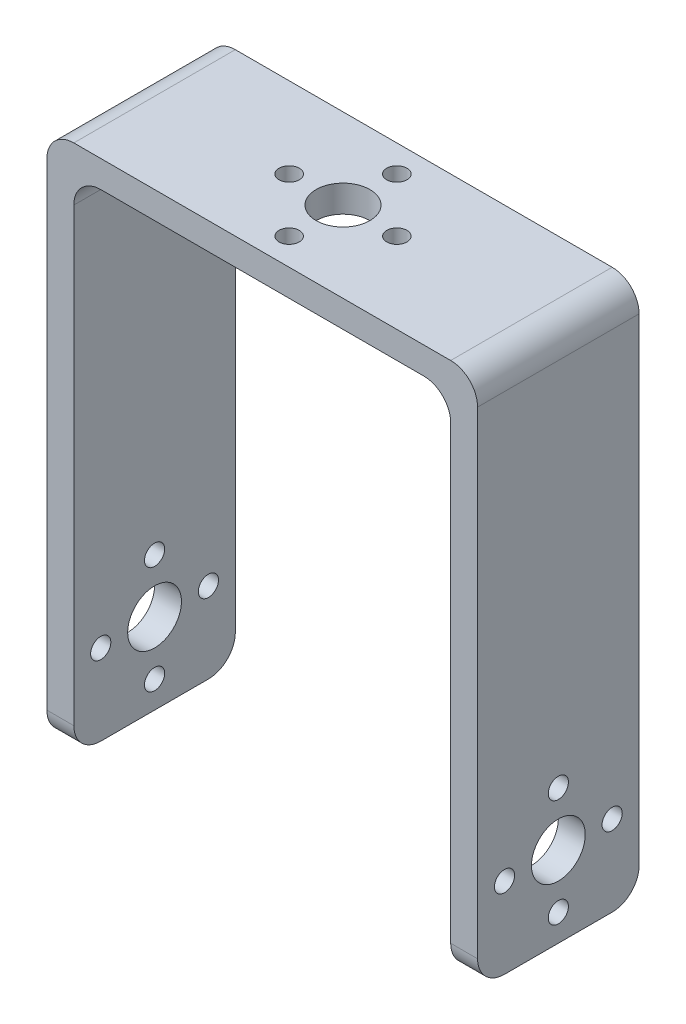
ISO-10303-21;
HEADER;
FILE_DESCRIPTION(('STEP AP214'),'2;1');
FILE_NAME('part.step','',(''),(''),'','','');
FILE_SCHEMA(('AUTOMOTIVE_DESIGN { 1 0 10303 214 1 1 1 1 }'));
ENDSEC;
DATA;
#1=APPLICATION_CONTEXT('core data for automotive mechanical design processes');
#2=APPLICATION_PROTOCOL_DEFINITION('international standard','automotive_design',2000,#1);
#3=PRODUCT_CONTEXT('',#1,'mechanical');
#4=PRODUCT('Part','Part','',(#3));
#5=PRODUCT_RELATED_PRODUCT_CATEGORY('part','',(#4));
#6=PRODUCT_DEFINITION_FORMATION('','',#4);
#7=PRODUCT_DEFINITION_CONTEXT('part definition',#1,'design');
#8=PRODUCT_DEFINITION('design','',#6,#7);
#9=PRODUCT_DEFINITION_SHAPE('','',#8);
#10=(LENGTH_UNIT() NAMED_UNIT(*) SI_UNIT(.MILLI.,.METRE.));
#11=(NAMED_UNIT(*) PLANE_ANGLE_UNIT() SI_UNIT($,.RADIAN.));
#12=(NAMED_UNIT(*) SI_UNIT($,.STERADIAN.) SOLID_ANGLE_UNIT());
#13=UNCERTAINTY_MEASURE_WITH_UNIT(LENGTH_MEASURE(1.E-05),#10,'distance_accuracy_value','');
#14=(GEOMETRIC_REPRESENTATION_CONTEXT(3) GLOBAL_UNCERTAINTY_ASSIGNED_CONTEXT((#13)) GLOBAL_UNIT_ASSIGNED_CONTEXT((#10,
#11,#12)) REPRESENTATION_CONTEXT('',''));
#15=CARTESIAN_POINT('',(0.,0.,0.));
#16=DIRECTION('',(0.,0.,1.));
#17=DIRECTION('',(1.,0.,0.));
#18=AXIS2_PLACEMENT_3D('',#15,#16,#17);
#19=CARTESIAN_POINT('',(20.0522878512897,0.,24.));
#20=DIRECTION('',(1.,0.,0.));
#21=DIRECTION('',(0.,0.,-1.));
#22=AXIS2_PLACEMENT_3D('',#19,#20,#21);
#23=PLANE('',#22);
#24=CARTESIAN_POINT('',(20.0522878512897,-26.738038277512,4.));
#25=DIRECTION('',(1.,0.,0.));
#26=DIRECTION('',(0.,0.,-1.));
#27=AXIS2_PLACEMENT_3D('',#24,#25,#26);
#28=CIRCLE('',#27,1.5);
#29=CARTESIAN_POINT('',(20.0522878512897,-26.738038277512,2.5));
#30=VERTEX_POINT('',#29);
#31=EDGE_CURVE('E337',#30,#30,#28,.T.);
#32=ORIENTED_EDGE('',*,*,#31,.T.);
#33=EDGE_LOOP('',(#32));
#34=FACE_BOUND('',#33,.T.);
#35=CARTESIAN_POINT('',(20.0522878512897,-26.7380382775119,20.));
#36=DIRECTION('',(1.,0.,0.));
#37=DIRECTION('',(0.,0.,-1.));
#38=AXIS2_PLACEMENT_3D('',#35,#36,#37);
#39=CIRCLE('',#38,1.5);
#40=CARTESIAN_POINT('',(20.0522878512897,-26.7380382775119,18.5));
#41=VERTEX_POINT('',#40);
#42=EDGE_CURVE('E331',#41,#41,#39,.T.);
#43=ORIENTED_EDGE('',*,*,#42,.T.);
#44=EDGE_LOOP('',(#43));
#45=FACE_BOUND('',#44,.T.);
#46=CARTESIAN_POINT('',(20.0522878512897,-34.738038277512,12.));
#47=DIRECTION('',(1.,0.,0.));
#48=DIRECTION('',(0.,0.,-1.));
#49=AXIS2_PLACEMENT_3D('',#46,#47,#48);
#50=CIRCLE('',#49,1.5);
#51=CARTESIAN_POINT('',(20.0522878512897,-34.738038277512,10.5));
#52=VERTEX_POINT('',#51);
#53=EDGE_CURVE('E325',#52,#52,#50,.T.);
#54=ORIENTED_EDGE('',*,*,#53,.T.);
#55=EDGE_LOOP('',(#54));
#56=FACE_BOUND('',#55,.T.);
#57=CARTESIAN_POINT('',(20.0522878512897,-18.738038277512,11.9999999999999));
#58=DIRECTION('',(1.,0.,0.));
#59=DIRECTION('',(0.,0.,-1.));
#60=AXIS2_PLACEMENT_3D('',#57,#58,#59);
#61=CIRCLE('',#60,1.5);
#62=CARTESIAN_POINT('',(20.0522878512897,-18.738038277512,10.4999999999999));
#63=VERTEX_POINT('',#62);
#64=EDGE_CURVE('E319',#63,#63,#61,.T.);
#65=ORIENTED_EDGE('',*,*,#64,.T.);
#66=EDGE_LOOP('',(#65));
#67=FACE_BOUND('',#66,.T.);
#68=CARTESIAN_POINT('',(20.0522878512897,-26.738038277512,12.));
#69=DIRECTION('',(1.,0.,0.));
#70=DIRECTION('',(0.,0.,-1.));
#71=AXIS2_PLACEMENT_3D('',#68,#69,#70);
#72=CIRCLE('',#71,4.);
#73=CARTESIAN_POINT('',(20.0522878512897,-26.738038277512,8.));
#74=VERTEX_POINT('',#73);
#75=EDGE_CURVE('E272',#74,#74,#72,.T.);
#76=ORIENTED_EDGE('',*,*,#75,.T.);
#77=EDGE_LOOP('',(#76));
#78=FACE_BOUND('',#77,.T.);
#79=DIRECTION('',(0.,-1.,0.));
#80=VECTOR('',#79,1.);
#81=CARTESIAN_POINT('',(20.0522878512897,0.,24.));
#82=LINE('',#81,#80);
#83=CARTESIAN_POINT('',(20.0522878512897,32.261961722488,24.));
#84=VERTEX_POINT('',#83);
#85=CARTESIAN_POINT('',(20.0522878512897,-34.738038277512,24.));
#86=VERTEX_POINT('',#85);
#87=EDGE_CURVE('E175',#84,#86,#82,.T.);
#88=ORIENTED_EDGE('',*,*,#87,.F.);
#89=DIRECTION('',(0.,0.,-1.));
#90=VECTOR('',#89,1.);
#91=CARTESIAN_POINT('',(20.0522878512897,32.261961722488,0.));
#92=LINE('',#91,#90);
#93=CARTESIAN_POINT('',(20.0522878512897,32.261961722488,0.));
#94=VERTEX_POINT('',#93);
#95=EDGE_CURVE('E235',#84,#94,#92,.T.);
#96=ORIENTED_EDGE('',*,*,#95,.T.);
#97=DIRECTION('',(0.,-1.,0.));
#98=VECTOR('',#97,1.);
#99=CARTESIAN_POINT('',(20.0522878512897,0.,0.));
#100=LINE('',#99,#98);
#101=CARTESIAN_POINT('',(20.0522878512897,-34.738038277512,0.));
#102=VERTEX_POINT('',#101);
#103=EDGE_CURVE('E268',#94,#102,#100,.T.);
#104=ORIENTED_EDGE('',*,*,#103,.T.);
#105=CARTESIAN_POINT('',(20.0522878512897,-34.738038277512,4.));
#106=DIRECTION('',(1.,0.,0.));
#107=DIRECTION('',(0.,0.,-1.));
#108=AXIS2_PLACEMENT_3D('',#105,#106,#107);
#109=CIRCLE('',#108,4.);
#110=CARTESIAN_POINT('',(20.0522878512897,-38.738038277512,4.));
#111=VERTEX_POINT('',#110);
#112=EDGE_CURVE('E233',#102,#111,#109,.F.);
#113=ORIENTED_EDGE('',*,*,#112,.T.);
#114=DIRECTION('',(0.,0.,-1.));
#115=VECTOR('',#114,1.);
#116=CARTESIAN_POINT('',(20.0522878512897,-38.738038277512,24.));
#117=LINE('',#116,#115);
#118=CARTESIAN_POINT('',(20.0522878512897,-38.738038277512,20.));
#119=VERTEX_POINT('',#118);
#120=EDGE_CURVE('E193',#119,#111,#117,.T.);
#121=ORIENTED_EDGE('',*,*,#120,.F.);
#122=CARTESIAN_POINT('',(20.0522878512897,-34.738038277512,20.));
#123=DIRECTION('',(1.,0.,0.));
#124=DIRECTION('',(0.,0.,-1.));
#125=AXIS2_PLACEMENT_3D('',#122,#123,#124);
#126=CIRCLE('',#125,4.);
#127=EDGE_CURVE('E231',#119,#86,#126,.F.);
#128=ORIENTED_EDGE('',*,*,#127,.T.);
#129=EDGE_LOOP('',(#88,#96,#104,#113,#121,#128));
#130=FACE_BOUND('',#129,.T.);
#131=ADVANCED_FACE('F34',(#34,#45,#56,#67,#78,#130),#23,.F.);
#132=CARTESIAN_POINT('',(0.,-38.738038277512,24.));
#133=DIRECTION('',(0.,1.,0.));
#134=DIRECTION('',(0.,0.,1.));
#135=AXIS2_PLACEMENT_3D('',#132,#133,#134);
#136=PLANE('',#135);
#137=ORIENTED_EDGE('',*,*,#120,.T.);
#138=DIRECTION('',(1.,0.,0.));
#139=VECTOR('',#138,1.);
#140=CARTESIAN_POINT('',(0.,-38.738038277512,4.));
#141=LINE('',#140,#139);
#142=CARTESIAN_POINT('',(24.0522878512897,-38.738038277512,4.));
#143=VERTEX_POINT('',#142);
#144=EDGE_CURVE('E244',#111,#143,#141,.T.);
#145=ORIENTED_EDGE('',*,*,#144,.T.);
#146=DIRECTION('',(0.,0.,-1.));
#147=VECTOR('',#146,1.);
#148=CARTESIAN_POINT('',(24.0522878512897,-38.738038277512,24.));
#149=LINE('',#148,#147);
#150=CARTESIAN_POINT('',(24.0522878512897,-38.738038277512,20.));
#151=VERTEX_POINT('',#150);
#152=EDGE_CURVE('E191',#151,#143,#149,.T.);
#153=ORIENTED_EDGE('',*,*,#152,.F.);
#154=DIRECTION('',(1.,0.,0.));
#155=VECTOR('',#154,1.);
#156=CARTESIAN_POINT('',(20.0522878512897,-38.738038277512,20.));
#157=LINE('',#156,#155);
#158=EDGE_CURVE('E242',#151,#119,#157,.F.);
#159=ORIENTED_EDGE('',*,*,#158,.T.);
#160=EDGE_LOOP('',(#137,#145,#153,#159));
#161=FACE_BOUND('',#160,.T.);
#162=ADVANCED_FACE('F431',(#161),#136,.F.);
#163=CARTESIAN_POINT('',(24.0522878512897,0.,24.));
#164=DIRECTION('',(1.,0.,0.));
#165=DIRECTION('',(0.,0.,-1.));
#166=AXIS2_PLACEMENT_3D('',#163,#164,#165);
#167=PLANE('',#166);
#168=CARTESIAN_POINT('',(24.0522878512897,-26.738038277512,4.));
#169=DIRECTION('',(1.,0.,0.));
#170=DIRECTION('',(0.,0.,-1.));
#171=AXIS2_PLACEMENT_3D('',#168,#169,#170);
#172=CIRCLE('',#171,1.5);
#173=CARTESIAN_POINT('',(24.0522878512897,-26.738038277512,2.5));
#174=VERTEX_POINT('',#173);
#175=EDGE_CURVE('E334',#174,#174,#172,.T.);
#176=ORIENTED_EDGE('',*,*,#175,.F.);
#177=EDGE_LOOP('',(#176));
#178=FACE_BOUND('',#177,.T.);
#179=CARTESIAN_POINT('',(24.0522878512897,-26.7380382775119,20.));
#180=DIRECTION('',(1.,0.,0.));
#181=DIRECTION('',(0.,0.,-1.));
#182=AXIS2_PLACEMENT_3D('',#179,#180,#181);
#183=CIRCLE('',#182,1.5);
#184=CARTESIAN_POINT('',(24.0522878512897,-26.7380382775119,18.5));
#185=VERTEX_POINT('',#184);
#186=EDGE_CURVE('E328',#185,#185,#183,.T.);
#187=ORIENTED_EDGE('',*,*,#186,.F.);
#188=EDGE_LOOP('',(#187));
#189=FACE_BOUND('',#188,.T.);
#190=CARTESIAN_POINT('',(24.0522878512897,-34.738038277512,12.));
#191=DIRECTION('',(1.,0.,0.));
#192=DIRECTION('',(0.,0.,-1.));
#193=AXIS2_PLACEMENT_3D('',#190,#191,#192);
#194=CIRCLE('',#193,1.5);
#195=CARTESIAN_POINT('',(24.0522878512897,-34.738038277512,10.5));
#196=VERTEX_POINT('',#195);
#197=EDGE_CURVE('E322',#196,#196,#194,.T.);
#198=ORIENTED_EDGE('',*,*,#197,.F.);
#199=EDGE_LOOP('',(#198));
#200=FACE_BOUND('',#199,.T.);
#201=CARTESIAN_POINT('',(24.0522878512897,-18.738038277512,11.9999999999999));
#202=DIRECTION('',(1.,0.,0.));
#203=DIRECTION('',(0.,0.,-1.));
#204=AXIS2_PLACEMENT_3D('',#201,#202,#203);
#205=CIRCLE('',#204,1.5);
#206=CARTESIAN_POINT('',(24.0522878512897,-18.738038277512,10.4999999999999));
#207=VERTEX_POINT('',#206);
#208=EDGE_CURVE('E316',#207,#207,#205,.T.);
#209=ORIENTED_EDGE('',*,*,#208,.F.);
#210=EDGE_LOOP('',(#209));
#211=FACE_BOUND('',#210,.T.);
#212=CARTESIAN_POINT('',(24.0522878512897,-26.738038277512,12.));
#213=DIRECTION('',(1.,0.,0.));
#214=DIRECTION('',(0.,0.,-1.));
#215=AXIS2_PLACEMENT_3D('',#212,#213,#214);
#216=CIRCLE('',#215,4.);
#217=CARTESIAN_POINT('',(24.0522878512897,-26.738038277512,8.));
#218=VERTEX_POINT('',#217);
#219=EDGE_CURVE('E313',#218,#218,#216,.T.);
#220=ORIENTED_EDGE('',*,*,#219,.F.);
#221=EDGE_LOOP('',(#220));
#222=FACE_BOUND('',#221,.T.);
#223=DIRECTION('',(0.,-1.,0.));
#224=VECTOR('',#223,1.);
#225=CARTESIAN_POINT('',(24.0522878512897,0.,0.));
#226=LINE('',#225,#224);
#227=CARTESIAN_POINT('',(24.0522878512897,36.261961722488,0.));
#228=VERTEX_POINT('',#227);
#229=CARTESIAN_POINT('',(24.0522878512897,-34.738038277512,0.));
#230=VERTEX_POINT('',#229);
#231=EDGE_CURVE('E271',#228,#230,#226,.T.);
#232=ORIENTED_EDGE('',*,*,#231,.F.);
#233=DIRECTION('',(0.,0.,-1.));
#234=VECTOR('',#233,1.);
#235=CARTESIAN_POINT('',(24.0522878512897,36.261961722488,24.));
#236=LINE('',#235,#234);
#237=CARTESIAN_POINT('',(24.0522878512897,36.261961722488,24.));
#238=VERTEX_POINT('',#237);
#239=EDGE_CURVE('E240',#228,#238,#236,.F.);
#240=ORIENTED_EDGE('',*,*,#239,.T.);
#241=DIRECTION('',(0.,-1.,0.));
#242=VECTOR('',#241,1.);
#243=CARTESIAN_POINT('',(24.0522878512897,0.,24.));
#244=LINE('',#243,#242);
#245=CARTESIAN_POINT('',(24.0522878512897,-34.738038277512,24.));
#246=VERTEX_POINT('',#245);
#247=EDGE_CURVE('E179',#238,#246,#244,.T.);
#248=ORIENTED_EDGE('',*,*,#247,.T.);
#249=CARTESIAN_POINT('',(24.0522878512897,-34.738038277512,20.));
#250=DIRECTION('',(1.,0.,0.));
#251=DIRECTION('',(0.,0.,-1.));
#252=AXIS2_PLACEMENT_3D('',#249,#250,#251);
#253=CIRCLE('',#252,4.);
#254=EDGE_CURVE('E57',#246,#151,#253,.T.);
#255=ORIENTED_EDGE('',*,*,#254,.T.);
#256=ORIENTED_EDGE('',*,*,#152,.T.);
#257=CARTESIAN_POINT('',(24.0522878512897,-34.738038277512,4.));
#258=DIRECTION('',(1.,0.,0.));
#259=DIRECTION('',(0.,0.,-1.));
#260=AXIS2_PLACEMENT_3D('',#257,#258,#259);
#261=CIRCLE('',#260,4.);
#262=EDGE_CURVE('E49',#143,#230,#261,.T.);
#263=ORIENTED_EDGE('',*,*,#262,.T.);
#264=EDGE_LOOP('',(#232,#240,#248,#255,#256,#263));
#265=FACE_BOUND('',#264,.T.);
#266=ADVANCED_FACE('F306',(#178,#189,#200,#211,#222,#265),#167,.T.);
#267=CARTESIAN_POINT('',(0.,40.261961722488,24.));
#268=DIRECTION('',(0.,1.,0.));
#269=DIRECTION('',(0.,0.,1.));
#270=AXIS2_PLACEMENT_3D('',#267,#268,#269);
#271=PLANE('',#270);
#272=CARTESIAN_POINT('',(-7.94771214871035,40.261961722488,12.));
#273=DIRECTION('',(0.,1.,0.));
#274=DIRECTION('',(0.,0.,1.));
#275=AXIS2_PLACEMENT_3D('',#272,#273,#274);
#276=CIRCLE('',#275,4.);
#277=CARTESIAN_POINT('',(-7.94771214871035,40.261961722488,16.));
#278=VERTEX_POINT('',#277);
#279=EDGE_CURVE('E394',#278,#278,#276,.T.);
#280=ORIENTED_EDGE('',*,*,#279,.F.);
#281=EDGE_LOOP('',(#280));
#282=FACE_BOUND('',#281,.T.);
#283=CARTESIAN_POINT('',(-15.9477121487103,40.261961722488,11.9999999999999));
#284=DIRECTION('',(0.,1.,0.));
#285=DIRECTION('',(0.,0.,1.));
#286=AXIS2_PLACEMENT_3D('',#283,#284,#285);
#287=CIRCLE('',#286,1.5);
#288=CARTESIAN_POINT('',(-15.9477121487103,40.261961722488,13.4999999999999));
#289=VERTEX_POINT('',#288);
#290=EDGE_CURVE('E388',#289,#289,#287,.T.);
#291=ORIENTED_EDGE('',*,*,#290,.F.);
#292=EDGE_LOOP('',(#291));
#293=FACE_BOUND('',#292,.T.);
#294=CARTESIAN_POINT('',(-7.94771214871038,40.261961722488,20.));
#295=DIRECTION('',(0.,1.,0.));
#296=DIRECTION('',(0.,0.,1.));
#297=AXIS2_PLACEMENT_3D('',#294,#295,#296);
#298=CIRCLE('',#297,1.5);
#299=CARTESIAN_POINT('',(-7.94771214871038,40.261961722488,21.5));
#300=VERTEX_POINT('',#299);
#301=EDGE_CURVE('E382',#300,#300,#298,.T.);
#302=ORIENTED_EDGE('',*,*,#301,.F.);
#303=EDGE_LOOP('',(#302));
#304=FACE_BOUND('',#303,.T.);
#305=CARTESIAN_POINT('',(0.0522878512896549,40.261961722488,12.));
#306=DIRECTION('',(0.,1.,0.));
#307=DIRECTION('',(0.,0.,1.));
#308=AXIS2_PLACEMENT_3D('',#305,#306,#307);
#309=CIRCLE('',#308,1.5);
#310=CARTESIAN_POINT('',(0.0522878512896549,40.261961722488,13.5));
#311=VERTEX_POINT('',#310);
#312=EDGE_CURVE('E376',#311,#311,#309,.T.);
#313=ORIENTED_EDGE('',*,*,#312,.F.);
#314=EDGE_LOOP('',(#313));
#315=FACE_BOUND('',#314,.T.);
#316=CARTESIAN_POINT('',(-7.94771214871025,40.261961722488,4.));
#317=DIRECTION('',(0.,1.,0.));
#318=DIRECTION('',(0.,0.,1.));
#319=AXIS2_PLACEMENT_3D('',#316,#317,#318);
#320=CIRCLE('',#319,1.5);
#321=CARTESIAN_POINT('',(-7.94771214871025,40.261961722488,5.5));
#322=VERTEX_POINT('',#321);
#323=EDGE_CURVE('E373',#322,#322,#320,.T.);
#324=ORIENTED_EDGE('',*,*,#323,.F.);
#325=EDGE_LOOP('',(#324));
#326=FACE_BOUND('',#325,.T.);
#327=DIRECTION('',(1.,0.,0.));
#328=VECTOR('',#327,1.);
#329=CARTESIAN_POINT('',(0.,40.261961722488,0.));
#330=LINE('',#329,#328);
#331=CARTESIAN_POINT('',(-35.9477121487103,40.261961722488,0.));
#332=VERTEX_POINT('',#331);
#333=CARTESIAN_POINT('',(20.0522878512897,40.261961722488,0.));
#334=VERTEX_POINT('',#333);
#335=EDGE_CURVE('E275',#332,#334,#330,.T.);
#336=ORIENTED_EDGE('',*,*,#335,.F.);
#337=DIRECTION('',(0.,0.,-1.));
#338=VECTOR('',#337,1.);
#339=CARTESIAN_POINT('',(-35.9477121487103,40.261961722488,24.));
#340=LINE('',#339,#338);
#341=CARTESIAN_POINT('',(-35.9477121487103,40.261961722488,24.));
#342=VERTEX_POINT('',#341);
#343=EDGE_CURVE('E219',#332,#342,#340,.F.);
#344=ORIENTED_EDGE('',*,*,#343,.T.);
#345=DIRECTION('',(1.,0.,0.));
#346=VECTOR('',#345,1.);
#347=CARTESIAN_POINT('',(0.,40.261961722488,24.));
#348=LINE('',#347,#346);
#349=CARTESIAN_POINT('',(20.0522878512897,40.261961722488,24.));
#350=VERTEX_POINT('',#349);
#351=EDGE_CURVE('E264',#342,#350,#348,.T.);
#352=ORIENTED_EDGE('',*,*,#351,.T.);
#353=DIRECTION('',(0.,0.,-1.));
#354=VECTOR('',#353,1.);
#355=CARTESIAN_POINT('',(20.0522878512897,40.261961722488,24.));
#356=LINE('',#355,#354);
#357=EDGE_CURVE('E216',#350,#334,#356,.T.);
#358=ORIENTED_EDGE('',*,*,#357,.T.);
#359=EDGE_LOOP('',(#336,#344,#352,#358));
#360=FACE_BOUND('',#359,.T.);
#361=ADVANCED_FACE('F301',(#282,#293,#304,#315,#326,#360),#271,.T.);
#362=CARTESIAN_POINT('',(-39.9477121487103,0.,24.));
#363=DIRECTION('',(-1.,0.,0.));
#364=DIRECTION('',(0.,0.,1.));
#365=AXIS2_PLACEMENT_3D('',#362,#363,#364);
#366=PLANE('',#365);
#367=CARTESIAN_POINT('',(-39.9477121487103,-26.7380382775119,4.));
#368=DIRECTION('',(-1.,0.,0.));
#369=DIRECTION('',(0.,0.,1.));
#370=AXIS2_PLACEMENT_3D('',#367,#368,#369);
#371=CIRCLE('',#370,1.5);
#372=CARTESIAN_POINT('',(-39.9477121487103,-26.7380382775119,5.5));
#373=VERTEX_POINT('',#372);
#374=EDGE_CURVE('E364',#373,#373,#371,.T.);
#375=ORIENTED_EDGE('',*,*,#374,.F.);
#376=EDGE_LOOP('',(#375));
#377=FACE_BOUND('',#376,.T.);
#378=CARTESIAN_POINT('',(-39.9477121487103,-34.738038277512,12.));
#379=DIRECTION('',(-1.,0.,0.));
#380=DIRECTION('',(0.,0.,1.));
#381=AXIS2_PLACEMENT_3D('',#378,#379,#380);
#382=CIRCLE('',#381,1.5);
#383=CARTESIAN_POINT('',(-39.9477121487103,-34.738038277512,13.5));
#384=VERTEX_POINT('',#383);
#385=EDGE_CURVE('E358',#384,#384,#382,.T.);
#386=ORIENTED_EDGE('',*,*,#385,.F.);
#387=EDGE_LOOP('',(#386));
#388=FACE_BOUND('',#387,.T.);
#389=CARTESIAN_POINT('',(-39.9477121487103,-26.738038277512,12.));
#390=DIRECTION('',(-1.,0.,0.));
#391=DIRECTION('',(0.,0.,1.));
#392=AXIS2_PLACEMENT_3D('',#389,#390,#391);
#393=CIRCLE('',#392,4.);
#394=CARTESIAN_POINT('',(-39.9477121487103,-26.738038277512,16.));
#395=VERTEX_POINT('',#394);
#396=EDGE_CURVE('E352',#395,#395,#393,.T.);
#397=ORIENTED_EDGE('',*,*,#396,.F.);
#398=EDGE_LOOP('',(#397));
#399=FACE_BOUND('',#398,.T.);
#400=CARTESIAN_POINT('',(-39.9477121487103,-26.738038277512,20.));
#401=DIRECTION('',(-1.,0.,0.));
#402=DIRECTION('',(0.,0.,1.));
#403=AXIS2_PLACEMENT_3D('',#400,#401,#402);
#404=CIRCLE('',#403,1.5);
#405=CARTESIAN_POINT('',(-39.9477121487103,-26.738038277512,21.5));
#406=VERTEX_POINT('',#405);
#407=EDGE_CURVE('E346',#406,#406,#404,.T.);
#408=ORIENTED_EDGE('',*,*,#407,.F.);
#409=EDGE_LOOP('',(#408));
#410=FACE_BOUND('',#409,.T.);
#411=CARTESIAN_POINT('',(-39.9477121487103,-18.738038277512,12.0000000000001));
#412=DIRECTION('',(-1.,0.,0.));
#413=DIRECTION('',(0.,0.,1.));
#414=AXIS2_PLACEMENT_3D('',#411,#412,#413);
#415=CIRCLE('',#414,1.5);
#416=CARTESIAN_POINT('',(-39.9477121487103,-18.738038277512,13.5000000000001));
#417=VERTEX_POINT('',#416);
#418=EDGE_CURVE('E343',#417,#417,#415,.T.);
#419=ORIENTED_EDGE('',*,*,#418,.F.);
#420=EDGE_LOOP('',(#419));
#421=FACE_BOUND('',#420,.T.);
#422=DIRECTION('',(0.,1.,0.));
#423=VECTOR('',#422,1.);
#424=CARTESIAN_POINT('',(-39.9477121487103,0.,24.));
#425=LINE('',#424,#423);
#426=CARTESIAN_POINT('',(-39.9477121487103,-34.738038277512,24.));
#427=VERTEX_POINT('',#426);
#428=CARTESIAN_POINT('',(-39.9477121487103,36.261961722488,24.));
#429=VERTEX_POINT('',#428);
#430=EDGE_CURVE('E260',#427,#429,#425,.T.);
#431=ORIENTED_EDGE('',*,*,#430,.T.);
#432=DIRECTION('',(0.,0.,-1.));
#433=VECTOR('',#432,1.);
#434=CARTESIAN_POINT('',(-39.9477121487103,36.261961722488,24.));
#435=LINE('',#434,#433);
#436=CARTESIAN_POINT('',(-39.9477121487103,36.261961722488,0.));
#437=VERTEX_POINT('',#436);
#438=EDGE_CURVE('E205',#429,#437,#435,.T.);
#439=ORIENTED_EDGE('',*,*,#438,.T.);
#440=DIRECTION('',(0.,1.,0.));
#441=VECTOR('',#440,1.);
#442=CARTESIAN_POINT('',(-39.9477121487103,0.,0.));
#443=LINE('',#442,#441);
#444=CARTESIAN_POINT('',(-39.9477121487103,-34.738038277512,0.));
#445=VERTEX_POINT('',#444);
#446=EDGE_CURVE('E181',#445,#437,#443,.T.);
#447=ORIENTED_EDGE('',*,*,#446,.F.);
#448=CARTESIAN_POINT('',(-39.9477121487103,-34.738038277512,4.));
#449=DIRECTION('',(-1.,0.,0.));
#450=DIRECTION('',(0.,0.,1.));
#451=AXIS2_PLACEMENT_3D('',#448,#449,#450);
#452=CIRCLE('',#451,4.);
#453=CARTESIAN_POINT('',(-39.9477121487103,-38.738038277512,4.));
#454=VERTEX_POINT('',#453);
#455=EDGE_CURVE('E203',#445,#454,#452,.T.);
#456=ORIENTED_EDGE('',*,*,#455,.T.);
#457=DIRECTION('',(0.,0.,-1.));
#458=VECTOR('',#457,1.);
#459=CARTESIAN_POINT('',(-39.9477121487103,-38.738038277512,24.));
#460=LINE('',#459,#458);
#461=CARTESIAN_POINT('',(-39.9477121487103,-38.738038277512,20.));
#462=VERTEX_POINT('',#461);
#463=EDGE_CURVE('E188',#462,#454,#460,.T.);
#464=ORIENTED_EDGE('',*,*,#463,.F.);
#465=CARTESIAN_POINT('',(-39.9477121487103,-34.738038277512,20.));
#466=DIRECTION('',(-1.,0.,0.));
#467=DIRECTION('',(0.,0.,1.));
#468=AXIS2_PLACEMENT_3D('',#465,#466,#467);
#469=CIRCLE('',#468,4.);
#470=EDGE_CURVE('E201',#462,#427,#469,.T.);
#471=ORIENTED_EDGE('',*,*,#470,.T.);
#472=EDGE_LOOP('',(#431,#439,#447,#456,#464,#471));
#473=FACE_BOUND('',#472,.T.);
#474=ADVANCED_FACE('F282',(#377,#388,#399,#410,#421,#473),#366,.T.);
#475=CARTESIAN_POINT('',(0.,-38.738038277512,24.));
#476=DIRECTION('',(0.,1.,0.));
#477=DIRECTION('',(0.,0.,1.));
#478=AXIS2_PLACEMENT_3D('',#475,#476,#477);
#479=PLANE('',#478);
#480=ORIENTED_EDGE('',*,*,#463,.T.);
#481=DIRECTION('',(1.,0.,0.));
#482=VECTOR('',#481,1.);
#483=CARTESIAN_POINT('',(0.,-38.738038277512,4.));
#484=LINE('',#483,#482);
#485=CARTESIAN_POINT('',(-35.9477121487103,-38.738038277512,4.));
#486=VERTEX_POINT('',#485);
#487=EDGE_CURVE('E159',#454,#486,#484,.T.);
#488=ORIENTED_EDGE('',*,*,#487,.T.);
#489=DIRECTION('',(0.,0.,-1.));
#490=VECTOR('',#489,1.);
#491=CARTESIAN_POINT('',(-35.9477121487103,-38.738038277512,24.));
#492=LINE('',#491,#490);
#493=CARTESIAN_POINT('',(-35.9477121487103,-38.738038277512,20.));
#494=VERTEX_POINT('',#493);
#495=EDGE_CURVE('E185',#494,#486,#492,.T.);
#496=ORIENTED_EDGE('',*,*,#495,.F.);
#497=DIRECTION('',(1.,0.,0.));
#498=VECTOR('',#497,1.);
#499=CARTESIAN_POINT('',(-39.9477121487103,-38.738038277512,20.));
#500=LINE('',#499,#498);
#501=EDGE_CURVE('E246',#494,#462,#500,.F.);
#502=ORIENTED_EDGE('',*,*,#501,.T.);
#503=EDGE_LOOP('',(#480,#488,#496,#502));
#504=FACE_BOUND('',#503,.T.);
#505=ADVANCED_FACE('F290',(#504),#479,.F.);
#506=CARTESIAN_POINT('',(-35.9477121487103,0.,24.));
#507=DIRECTION('',(-1.,0.,0.));
#508=DIRECTION('',(0.,0.,1.));
#509=AXIS2_PLACEMENT_3D('',#506,#507,#508);
#510=PLANE('',#509);
#511=CARTESIAN_POINT('',(-35.9477121487103,-26.7380382775119,4.));
#512=DIRECTION('',(-1.,0.,0.));
#513=DIRECTION('',(0.,0.,1.));
#514=AXIS2_PLACEMENT_3D('',#511,#512,#513);
#515=CIRCLE('',#514,1.5);
#516=CARTESIAN_POINT('',(-35.9477121487103,-26.7380382775119,5.5));
#517=VERTEX_POINT('',#516);
#518=EDGE_CURVE('E367',#517,#517,#515,.T.);
#519=ORIENTED_EDGE('',*,*,#518,.T.);
#520=EDGE_LOOP('',(#519));
#521=FACE_BOUND('',#520,.T.);
#522=CARTESIAN_POINT('',(-35.9477121487103,-34.738038277512,12.));
#523=DIRECTION('',(-1.,0.,0.));
#524=DIRECTION('',(0.,0.,1.));
#525=AXIS2_PLACEMENT_3D('',#522,#523,#524);
#526=CIRCLE('',#525,1.5);
#527=CARTESIAN_POINT('',(-35.9477121487103,-34.738038277512,13.5));
#528=VERTEX_POINT('',#527);
#529=EDGE_CURVE('E361',#528,#528,#526,.T.);
#530=ORIENTED_EDGE('',*,*,#529,.T.);
#531=EDGE_LOOP('',(#530));
#532=FACE_BOUND('',#531,.T.);
#533=CARTESIAN_POINT('',(-35.9477121487103,-26.738038277512,12.));
#534=DIRECTION('',(-1.,0.,0.));
#535=DIRECTION('',(0.,0.,1.));
#536=AXIS2_PLACEMENT_3D('',#533,#534,#535);
#537=CIRCLE('',#536,4.);
#538=CARTESIAN_POINT('',(-35.9477121487103,-26.738038277512,16.));
#539=VERTEX_POINT('',#538);
#540=EDGE_CURVE('E355',#539,#539,#537,.T.);
#541=ORIENTED_EDGE('',*,*,#540,.T.);
#542=EDGE_LOOP('',(#541));
#543=FACE_BOUND('',#542,.T.);
#544=CARTESIAN_POINT('',(-35.9477121487103,-26.738038277512,20.));
#545=DIRECTION('',(-1.,0.,0.));
#546=DIRECTION('',(0.,0.,1.));
#547=AXIS2_PLACEMENT_3D('',#544,#545,#546);
#548=CIRCLE('',#547,1.5);
#549=CARTESIAN_POINT('',(-35.9477121487103,-26.738038277512,21.5));
#550=VERTEX_POINT('',#549);
#551=EDGE_CURVE('E349',#550,#550,#548,.T.);
#552=ORIENTED_EDGE('',*,*,#551,.T.);
#553=EDGE_LOOP('',(#552));
#554=FACE_BOUND('',#553,.T.);
#555=CARTESIAN_POINT('',(-35.9477121487103,-18.738038277512,12.0000000000001));
#556=DIRECTION('',(-1.,0.,0.));
#557=DIRECTION('',(0.,0.,1.));
#558=AXIS2_PLACEMENT_3D('',#555,#556,#557);
#559=CIRCLE('',#558,1.5);
#560=CARTESIAN_POINT('',(-35.9477121487103,-18.738038277512,13.5000000000001));
#561=VERTEX_POINT('',#560);
#562=EDGE_CURVE('E340',#561,#561,#559,.T.);
#563=ORIENTED_EDGE('',*,*,#562,.T.);
#564=EDGE_LOOP('',(#563));
#565=FACE_BOUND('',#564,.T.);
#566=DIRECTION('',(0.,1.,0.));
#567=VECTOR('',#566,1.);
#568=CARTESIAN_POINT('',(-35.9477121487103,0.,0.));
#569=LINE('',#568,#567);
#570=CARTESIAN_POINT('',(-35.9477121487103,-34.738038277512,0.));
#571=VERTEX_POINT('',#570);
#572=CARTESIAN_POINT('',(-35.9477121487103,32.261961722488,0.));
#573=VERTEX_POINT('',#572);
#574=EDGE_CURVE('E176',#571,#573,#569,.T.);
#575=ORIENTED_EDGE('',*,*,#574,.T.);
#576=DIRECTION('',(0.,0.,-1.));
#577=VECTOR('',#576,1.);
#578=CARTESIAN_POINT('',(-35.9477121487103,32.261961722488,24.));
#579=LINE('',#578,#577);
#580=CARTESIAN_POINT('',(-35.9477121487103,32.261961722488,24.));
#581=VERTEX_POINT('',#580);
#582=EDGE_CURVE('E153',#573,#581,#579,.F.);
#583=ORIENTED_EDGE('',*,*,#582,.T.);
#584=DIRECTION('',(0.,1.,0.));
#585=VECTOR('',#584,1.);
#586=CARTESIAN_POINT('',(-35.9477121487103,0.,24.));
#587=LINE('',#586,#585);
#588=CARTESIAN_POINT('',(-35.9477121487103,-34.738038277512,24.));
#589=VERTEX_POINT('',#588);
#590=EDGE_CURVE('E256',#589,#581,#587,.T.);
#591=ORIENTED_EDGE('',*,*,#590,.F.);
#592=CARTESIAN_POINT('',(-35.9477121487103,-34.738038277512,20.));
#593=DIRECTION('',(-1.,0.,0.));
#594=DIRECTION('',(0.,0.,1.));
#595=AXIS2_PLACEMENT_3D('',#592,#593,#594);
#596=CIRCLE('',#595,4.);
#597=EDGE_CURVE('E169',#589,#494,#596,.F.);
#598=ORIENTED_EDGE('',*,*,#597,.T.);
#599=ORIENTED_EDGE('',*,*,#495,.T.);
#600=CARTESIAN_POINT('',(-35.9477121487103,-34.738038277512,4.));
#601=DIRECTION('',(-1.,0.,0.));
#602=DIRECTION('',(0.,0.,1.));
#603=AXIS2_PLACEMENT_3D('',#600,#601,#602);
#604=CIRCLE('',#603,4.);
#605=EDGE_CURVE('E198',#486,#571,#604,.F.);
#606=ORIENTED_EDGE('',*,*,#605,.T.);
#607=EDGE_LOOP('',(#575,#583,#591,#598,#599,#606));
#608=FACE_BOUND('',#607,.T.);
#609=ADVANCED_FACE('F292',(#521,#532,#543,#554,#565,#608),#510,.F.);
#610=CARTESIAN_POINT('',(0.,36.261961722488,24.));
#611=DIRECTION('',(0.,1.,0.));
#612=DIRECTION('',(0.,0.,1.));
#613=AXIS2_PLACEMENT_3D('',#610,#611,#612);
#614=PLANE('',#613);
#615=CARTESIAN_POINT('',(-7.94771214871035,36.261961722488,12.));
#616=DIRECTION('',(0.,1.,0.));
#617=DIRECTION('',(0.,0.,1.));
#618=AXIS2_PLACEMENT_3D('',#615,#616,#617);
#619=CIRCLE('',#618,4.);
#620=CARTESIAN_POINT('',(-7.94771214871035,36.261961722488,16.));
#621=VERTEX_POINT('',#620);
#622=EDGE_CURVE('E397',#621,#621,#619,.T.);
#623=ORIENTED_EDGE('',*,*,#622,.T.);
#624=EDGE_LOOP('',(#623));
#625=FACE_BOUND('',#624,.T.);
#626=CARTESIAN_POINT('',(-15.9477121487103,36.261961722488,11.9999999999999));
#627=DIRECTION('',(0.,1.,0.));
#628=DIRECTION('',(0.,0.,1.));
#629=AXIS2_PLACEMENT_3D('',#626,#627,#628);
#630=CIRCLE('',#629,1.5);
#631=CARTESIAN_POINT('',(-15.9477121487103,36.261961722488,13.4999999999999));
#632=VERTEX_POINT('',#631);
#633=EDGE_CURVE('E391',#632,#632,#630,.T.);
#634=ORIENTED_EDGE('',*,*,#633,.T.);
#635=EDGE_LOOP('',(#634));
#636=FACE_BOUND('',#635,.T.);
#637=CARTESIAN_POINT('',(-7.94771214871038,36.261961722488,20.));
#638=DIRECTION('',(0.,1.,0.));
#639=DIRECTION('',(0.,0.,1.));
#640=AXIS2_PLACEMENT_3D('',#637,#638,#639);
#641=CIRCLE('',#640,1.5);
#642=CARTESIAN_POINT('',(-7.94771214871038,36.261961722488,21.5));
#643=VERTEX_POINT('',#642);
#644=EDGE_CURVE('E385',#643,#643,#641,.T.);
#645=ORIENTED_EDGE('',*,*,#644,.T.);
#646=EDGE_LOOP('',(#645));
#647=FACE_BOUND('',#646,.T.);
#648=CARTESIAN_POINT('',(0.0522878512896549,36.261961722488,12.));
#649=DIRECTION('',(0.,1.,0.));
#650=DIRECTION('',(0.,0.,1.));
#651=AXIS2_PLACEMENT_3D('',#648,#649,#650);
#652=CIRCLE('',#651,1.5);
#653=CARTESIAN_POINT('',(0.0522878512896549,36.261961722488,13.5));
#654=VERTEX_POINT('',#653);
#655=EDGE_CURVE('E379',#654,#654,#652,.T.);
#656=ORIENTED_EDGE('',*,*,#655,.T.);
#657=EDGE_LOOP('',(#656));
#658=FACE_BOUND('',#657,.T.);
#659=CARTESIAN_POINT('',(-7.94771214871025,36.261961722488,4.));
#660=DIRECTION('',(0.,1.,0.));
#661=DIRECTION('',(0.,0.,1.));
#662=AXIS2_PLACEMENT_3D('',#659,#660,#661);
#663=CIRCLE('',#662,1.5);
#664=CARTESIAN_POINT('',(-7.94771214871025,36.261961722488,5.5));
#665=VERTEX_POINT('',#664);
#666=EDGE_CURVE('E370',#665,#665,#663,.T.);
#667=ORIENTED_EDGE('',*,*,#666,.T.);
#668=EDGE_LOOP('',(#667));
#669=FACE_BOUND('',#668,.T.);
#670=DIRECTION('',(1.,0.,0.));
#671=VECTOR('',#670,1.);
#672=CARTESIAN_POINT('',(0.,36.261961722488,24.));
#673=LINE('',#672,#671);
#674=CARTESIAN_POINT('',(-31.9477121487103,36.261961722488,24.));
#675=VERTEX_POINT('',#674);
#676=CARTESIAN_POINT('',(16.0522878512897,36.261961722488,24.));
#677=VERTEX_POINT('',#676);
#678=EDGE_CURVE('E168',#675,#677,#673,.T.);
#679=ORIENTED_EDGE('',*,*,#678,.F.);
#680=DIRECTION('',(0.,0.,-1.));
#681=VECTOR('',#680,1.);
#682=CARTESIAN_POINT('',(-31.9477121487103,36.261961722488,0.));
#683=LINE('',#682,#681);
#684=CARTESIAN_POINT('',(-31.9477121487103,36.261961722488,0.));
#685=VERTEX_POINT('',#684);
#686=EDGE_CURVE('E152',#675,#685,#683,.T.);
#687=ORIENTED_EDGE('',*,*,#686,.T.);
#688=DIRECTION('',(1.,0.,0.));
#689=VECTOR('',#688,1.);
#690=CARTESIAN_POINT('',(0.,36.261961722488,0.));
#691=LINE('',#690,#689);
#692=CARTESIAN_POINT('',(16.0522878512897,36.261961722488,0.));
#693=VERTEX_POINT('',#692);
#694=EDGE_CURVE('E165',#685,#693,#691,.T.);
#695=ORIENTED_EDGE('',*,*,#694,.T.);
#696=DIRECTION('',(0.,0.,-1.));
#697=VECTOR('',#696,1.);
#698=CARTESIAN_POINT('',(16.0522878512897,36.261961722488,24.));
#699=LINE('',#698,#697);
#700=EDGE_CURVE('E170',#693,#677,#699,.F.);
#701=ORIENTED_EDGE('',*,*,#700,.T.);
#702=EDGE_LOOP('',(#679,#687,#695,#701));
#703=FACE_BOUND('',#702,.T.);
#704=ADVANCED_FACE('F164',(#625,#636,#647,#658,#669,#703),#614,.F.);
#705=CARTESIAN_POINT('',(0.,0.,24.));
#706=DIRECTION('',(0.,0.,1.));
#707=DIRECTION('',(1.,0.,0.));
#708=AXIS2_PLACEMENT_3D('',#705,#706,#707);
#709=PLANE('',#708);
#710=ORIENTED_EDGE('',*,*,#351,.F.);
#711=CARTESIAN_POINT('',(-35.9477121487103,36.261961722488,24.));
#712=DIRECTION('',(0.,0.,1.));
#713=DIRECTION('',(1.,0.,0.));
#714=AXIS2_PLACEMENT_3D('',#711,#712,#713);
#715=CIRCLE('',#714,4.);
#716=EDGE_CURVE('E229',#342,#429,#715,.T.);
#717=ORIENTED_EDGE('',*,*,#716,.T.);
#718=ORIENTED_EDGE('',*,*,#430,.F.);
#719=DIRECTION('',(1.,0.,0.));
#720=VECTOR('',#719,1.);
#721=CARTESIAN_POINT('',(-35.9477121487103,-34.738038277512,24.));
#722=LINE('',#721,#720);
#723=EDGE_CURVE('E221',#427,#589,#722,.T.);
#724=ORIENTED_EDGE('',*,*,#723,.T.);
#725=ORIENTED_EDGE('',*,*,#590,.T.);
#726=CARTESIAN_POINT('',(-31.9477121487103,32.261961722488,24.));
#727=DIRECTION('',(0.,0.,1.));
#728=DIRECTION('',(1.,0.,0.));
#729=AXIS2_PLACEMENT_3D('',#726,#727,#728);
#730=CIRCLE('',#729,4.);
#731=EDGE_CURVE('E158',#581,#675,#730,.F.);
#732=ORIENTED_EDGE('',*,*,#731,.T.);
#733=ORIENTED_EDGE('',*,*,#678,.T.);
#734=CARTESIAN_POINT('',(16.0522878512897,32.261961722488,24.));
#735=DIRECTION('',(0.,0.,1.));
#736=DIRECTION('',(1.,0.,0.));
#737=AXIS2_PLACEMENT_3D('',#734,#735,#736);
#738=CIRCLE('',#737,4.);
#739=EDGE_CURVE('E11',#677,#84,#738,.F.);
#740=ORIENTED_EDGE('',*,*,#739,.T.);
#741=ORIENTED_EDGE('',*,*,#87,.T.);
#742=DIRECTION('',(1.,0.,0.));
#743=VECTOR('',#742,1.);
#744=CARTESIAN_POINT('',(24.0522878512897,-34.738038277512,24.));
#745=LINE('',#744,#743);
#746=EDGE_CURVE('E224',#86,#246,#745,.T.);
#747=ORIENTED_EDGE('',*,*,#746,.T.);
#748=ORIENTED_EDGE('',*,*,#247,.F.);
#749=CARTESIAN_POINT('',(20.0522878512897,36.261961722488,24.));
#750=DIRECTION('',(0.,0.,1.));
#751=DIRECTION('',(1.,0.,0.));
#752=AXIS2_PLACEMENT_3D('',#749,#750,#751);
#753=CIRCLE('',#752,4.);
#754=EDGE_CURVE('E227',#238,#350,#753,.T.);
#755=ORIENTED_EDGE('',*,*,#754,.T.);
#756=EDGE_LOOP('',(#710,#717,#718,#724,#725,#732,#733,#740,#741,#747,#748,#755));
#757=FACE_BOUND('',#756,.T.);
#758=ADVANCED_FACE('F253',(#757),#709,.T.);
#759=CARTESIAN_POINT('',(0.,0.,0.));
#760=DIRECTION('',(0.,0.,1.));
#761=DIRECTION('',(1.,0.,0.));
#762=AXIS2_PLACEMENT_3D('',#759,#760,#761);
#763=PLANE('',#762);
#764=ORIENTED_EDGE('',*,*,#446,.T.);
#765=CARTESIAN_POINT('',(-35.9477121487103,36.261961722488,0.));
#766=DIRECTION('',(0.,0.,1.));
#767=DIRECTION('',(1.,0.,0.));
#768=AXIS2_PLACEMENT_3D('',#765,#766,#767);
#769=CIRCLE('',#768,4.);
#770=EDGE_CURVE('E214',#437,#332,#769,.F.);
#771=ORIENTED_EDGE('',*,*,#770,.T.);
#772=ORIENTED_EDGE('',*,*,#335,.T.);
#773=CARTESIAN_POINT('',(20.0522878512897,36.261961722488,0.));
#774=DIRECTION('',(0.,0.,1.));
#775=DIRECTION('',(1.,0.,0.));
#776=AXIS2_PLACEMENT_3D('',#773,#774,#775);
#777=CIRCLE('',#776,4.);
#778=EDGE_CURVE('E212',#334,#228,#777,.F.);
#779=ORIENTED_EDGE('',*,*,#778,.T.);
#780=ORIENTED_EDGE('',*,*,#231,.T.);
#781=DIRECTION('',(1.,0.,0.));
#782=VECTOR('',#781,1.);
#783=CARTESIAN_POINT('',(0.,-34.738038277512,0.));
#784=LINE('',#783,#782);
#785=EDGE_CURVE('E210',#230,#102,#784,.F.);
#786=ORIENTED_EDGE('',*,*,#785,.T.);
#787=ORIENTED_EDGE('',*,*,#103,.F.);
#788=CARTESIAN_POINT('',(16.0522878512897,32.261961722488,0.));
#789=DIRECTION('',(0.,0.,1.));
#790=DIRECTION('',(1.,0.,0.));
#791=AXIS2_PLACEMENT_3D('',#788,#789,#790);
#792=CIRCLE('',#791,4.);
#793=EDGE_CURVE('E42',#94,#693,#792,.T.);
#794=ORIENTED_EDGE('',*,*,#793,.T.);
#795=ORIENTED_EDGE('',*,*,#694,.F.);
#796=CARTESIAN_POINT('',(-31.9477121487103,32.261961722488,0.));
#797=DIRECTION('',(0.,0.,1.));
#798=DIRECTION('',(1.,0.,0.));
#799=AXIS2_PLACEMENT_3D('',#796,#797,#798);
#800=CIRCLE('',#799,4.);
#801=EDGE_CURVE('E148',#685,#573,#800,.T.);
#802=ORIENTED_EDGE('',*,*,#801,.T.);
#803=ORIENTED_EDGE('',*,*,#574,.F.);
#804=DIRECTION('',(1.,0.,0.));
#805=VECTOR('',#804,1.);
#806=CARTESIAN_POINT('',(0.,-34.738038277512,0.));
#807=LINE('',#806,#805);
#808=EDGE_CURVE('E208',#571,#445,#807,.F.);
#809=ORIENTED_EDGE('',*,*,#808,.T.);
#810=EDGE_LOOP('',(#764,#771,#772,#779,#780,#786,#787,#794,#795,#802,#803,#809));
#811=FACE_BOUND('',#810,.T.);
#812=ADVANCED_FACE('F173',(#811),#763,.F.);
#813=CARTESIAN_POINT('',(20.0522878512897,-26.738038277512,12.));
#814=DIRECTION('',(1.,0.,0.));
#815=DIRECTION('',(0.,0.,-1.));
#816=AXIS2_PLACEMENT_3D('',#813,#814,#815);
#817=CYLINDRICAL_SURFACE('',#816,4.);
#818=ORIENTED_EDGE('',*,*,#75,.F.);
#819=EDGE_LOOP('',(#818));
#820=FACE_BOUND('',#819,.T.);
#821=ORIENTED_EDGE('',*,*,#219,.T.);
#822=EDGE_LOOP('',(#821));
#823=FACE_BOUND('',#822,.T.);
#824=ADVANCED_FACE('F555',(#820,#823),#817,.F.);
#825=CARTESIAN_POINT('',(20.0522878512897,-18.738038277512,11.9999999999999));
#826=DIRECTION('',(1.,0.,0.));
#827=DIRECTION('',(0.,0.,-1.));
#828=AXIS2_PLACEMENT_3D('',#825,#826,#827);
#829=CYLINDRICAL_SURFACE('',#828,1.5);
#830=ORIENTED_EDGE('',*,*,#64,.F.);
#831=EDGE_LOOP('',(#830));
#832=FACE_BOUND('',#831,.T.);
#833=ORIENTED_EDGE('',*,*,#208,.T.);
#834=EDGE_LOOP('',(#833));
#835=FACE_BOUND('',#834,.T.);
#836=ADVANCED_FACE('F563',(#832,#835),#829,.F.);
#837=CARTESIAN_POINT('',(20.0522878512897,-34.738038277512,12.));
#838=DIRECTION('',(1.,0.,0.));
#839=DIRECTION('',(0.,0.,-1.));
#840=AXIS2_PLACEMENT_3D('',#837,#838,#839);
#841=CYLINDRICAL_SURFACE('',#840,1.5);
#842=ORIENTED_EDGE('',*,*,#53,.F.);
#843=EDGE_LOOP('',(#842));
#844=FACE_BOUND('',#843,.T.);
#845=ORIENTED_EDGE('',*,*,#197,.T.);
#846=EDGE_LOOP('',(#845));
#847=FACE_BOUND('',#846,.T.);
#848=ADVANCED_FACE('F571',(#844,#847),#841,.F.);
#849=CARTESIAN_POINT('',(20.0522878512897,-26.7380382775119,20.));
#850=DIRECTION('',(1.,0.,0.));
#851=DIRECTION('',(0.,0.,-1.));
#852=AXIS2_PLACEMENT_3D('',#849,#850,#851);
#853=CYLINDRICAL_SURFACE('',#852,1.5);
#854=ORIENTED_EDGE('',*,*,#42,.F.);
#855=EDGE_LOOP('',(#854));
#856=FACE_BOUND('',#855,.T.);
#857=ORIENTED_EDGE('',*,*,#186,.T.);
#858=EDGE_LOOP('',(#857));
#859=FACE_BOUND('',#858,.T.);
#860=ADVANCED_FACE('F579',(#856,#859),#853,.F.);
#861=CARTESIAN_POINT('',(20.0522878512897,-26.738038277512,4.));
#862=DIRECTION('',(1.,0.,0.));
#863=DIRECTION('',(0.,0.,-1.));
#864=AXIS2_PLACEMENT_3D('',#861,#862,#863);
#865=CYLINDRICAL_SURFACE('',#864,1.5);
#866=ORIENTED_EDGE('',*,*,#31,.F.);
#867=EDGE_LOOP('',(#866));
#868=FACE_BOUND('',#867,.T.);
#869=ORIENTED_EDGE('',*,*,#175,.T.);
#870=EDGE_LOOP('',(#869));
#871=FACE_BOUND('',#870,.T.);
#872=ADVANCED_FACE('F587',(#868,#871),#865,.F.);
#873=CARTESIAN_POINT('',(-35.9477121487103,-18.738038277512,12.0000000000001));
#874=DIRECTION('',(-1.,0.,0.));
#875=DIRECTION('',(0.,0.,1.));
#876=AXIS2_PLACEMENT_3D('',#873,#874,#875);
#877=CYLINDRICAL_SURFACE('',#876,1.5);
#878=ORIENTED_EDGE('',*,*,#562,.F.);
#879=EDGE_LOOP('',(#878));
#880=FACE_BOUND('',#879,.T.);
#881=ORIENTED_EDGE('',*,*,#418,.T.);
#882=EDGE_LOOP('',(#881));
#883=FACE_BOUND('',#882,.T.);
#884=ADVANCED_FACE('F595',(#880,#883),#877,.F.);
#885=CARTESIAN_POINT('',(-35.9477121487103,-26.738038277512,20.));
#886=DIRECTION('',(-1.,0.,0.));
#887=DIRECTION('',(0.,0.,1.));
#888=AXIS2_PLACEMENT_3D('',#885,#886,#887);
#889=CYLINDRICAL_SURFACE('',#888,1.5);
#890=ORIENTED_EDGE('',*,*,#551,.F.);
#891=EDGE_LOOP('',(#890));
#892=FACE_BOUND('',#891,.T.);
#893=ORIENTED_EDGE('',*,*,#407,.T.);
#894=EDGE_LOOP('',(#893));
#895=FACE_BOUND('',#894,.T.);
#896=ADVANCED_FACE('F603',(#892,#895),#889,.F.);
#897=CARTESIAN_POINT('',(-35.9477121487103,-26.738038277512,12.));
#898=DIRECTION('',(-1.,0.,0.));
#899=DIRECTION('',(0.,0.,1.));
#900=AXIS2_PLACEMENT_3D('',#897,#898,#899);
#901=CYLINDRICAL_SURFACE('',#900,4.);
#902=ORIENTED_EDGE('',*,*,#540,.F.);
#903=EDGE_LOOP('',(#902));
#904=FACE_BOUND('',#903,.T.);
#905=ORIENTED_EDGE('',*,*,#396,.T.);
#906=EDGE_LOOP('',(#905));
#907=FACE_BOUND('',#906,.T.);
#908=ADVANCED_FACE('F611',(#904,#907),#901,.F.);
#909=CARTESIAN_POINT('',(-35.9477121487103,-34.738038277512,12.));
#910=DIRECTION('',(-1.,0.,0.));
#911=DIRECTION('',(0.,0.,1.));
#912=AXIS2_PLACEMENT_3D('',#909,#910,#911);
#913=CYLINDRICAL_SURFACE('',#912,1.5);
#914=ORIENTED_EDGE('',*,*,#529,.F.);
#915=EDGE_LOOP('',(#914));
#916=FACE_BOUND('',#915,.T.);
#917=ORIENTED_EDGE('',*,*,#385,.T.);
#918=EDGE_LOOP('',(#917));
#919=FACE_BOUND('',#918,.T.);
#920=ADVANCED_FACE('F619',(#916,#919),#913,.F.);
#921=CARTESIAN_POINT('',(-35.9477121487103,-26.7380382775119,4.));
#922=DIRECTION('',(-1.,0.,0.));
#923=DIRECTION('',(0.,0.,1.));
#924=AXIS2_PLACEMENT_3D('',#921,#922,#923);
#925=CYLINDRICAL_SURFACE('',#924,1.5);
#926=ORIENTED_EDGE('',*,*,#518,.F.);
#927=EDGE_LOOP('',(#926));
#928=FACE_BOUND('',#927,.T.);
#929=ORIENTED_EDGE('',*,*,#374,.T.);
#930=EDGE_LOOP('',(#929));
#931=FACE_BOUND('',#930,.T.);
#932=ADVANCED_FACE('F444',(#928,#931),#925,.F.);
#933=CARTESIAN_POINT('',(-31.9477121487103,32.261961722488,24.));
#934=DIRECTION('',(0.,0.,1.));
#935=DIRECTION('',(1.,0.,0.));
#936=AXIS2_PLACEMENT_3D('',#933,#934,#935);
#937=CYLINDRICAL_SURFACE('',#936,4.);
#938=ORIENTED_EDGE('',*,*,#731,.F.);
#939=ORIENTED_EDGE('',*,*,#582,.F.);
#940=ORIENTED_EDGE('',*,*,#801,.F.);
#941=ORIENTED_EDGE('',*,*,#686,.F.);
#942=EDGE_LOOP('',(#938,#939,#940,#941));
#943=FACE_BOUND('',#942,.T.);
#944=ADVANCED_FACE('F151',(#943),#937,.F.);
#945=CARTESIAN_POINT('',(-35.9477121487103,36.261961722488,24.));
#946=DIRECTION('',(0.,0.,-1.));
#947=DIRECTION('',(-1.,0.,0.));
#948=AXIS2_PLACEMENT_3D('',#945,#946,#947);
#949=CYLINDRICAL_SURFACE('',#948,4.);
#950=ORIENTED_EDGE('',*,*,#716,.F.);
#951=ORIENTED_EDGE('',*,*,#343,.F.);
#952=ORIENTED_EDGE('',*,*,#770,.F.);
#953=ORIENTED_EDGE('',*,*,#438,.F.);
#954=EDGE_LOOP('',(#950,#951,#952,#953));
#955=FACE_BOUND('',#954,.T.);
#956=ADVANCED_FACE('F299',(#955),#949,.T.);
#957=CARTESIAN_POINT('',(16.0522878512897,32.261961722488,24.));
#958=DIRECTION('',(0.,0.,1.));
#959=DIRECTION('',(1.,0.,0.));
#960=AXIS2_PLACEMENT_3D('',#957,#958,#959);
#961=CYLINDRICAL_SURFACE('',#960,4.);
#962=ORIENTED_EDGE('',*,*,#739,.F.);
#963=ORIENTED_EDGE('',*,*,#700,.F.);
#964=ORIENTED_EDGE('',*,*,#793,.F.);
#965=ORIENTED_EDGE('',*,*,#95,.F.);
#966=EDGE_LOOP('',(#962,#963,#964,#965));
#967=FACE_BOUND('',#966,.T.);
#968=ADVANCED_FACE('F447',(#967),#961,.F.);
#969=CARTESIAN_POINT('',(20.0522878512897,36.261961722488,24.));
#970=DIRECTION('',(0.,0.,-1.));
#971=DIRECTION('',(-1.,0.,0.));
#972=AXIS2_PLACEMENT_3D('',#969,#970,#971);
#973=CYLINDRICAL_SURFACE('',#972,4.);
#974=ORIENTED_EDGE('',*,*,#754,.F.);
#975=ORIENTED_EDGE('',*,*,#239,.F.);
#976=ORIENTED_EDGE('',*,*,#778,.F.);
#977=ORIENTED_EDGE('',*,*,#357,.F.);
#978=EDGE_LOOP('',(#974,#975,#976,#977));
#979=FACE_BOUND('',#978,.T.);
#980=ADVANCED_FACE('F309',(#979),#973,.T.);
#981=CARTESIAN_POINT('',(0.,-34.738038277512,4.));
#982=DIRECTION('',(1.,0.,0.));
#983=DIRECTION('',(0.,0.,-1.));
#984=AXIS2_PLACEMENT_3D('',#981,#982,#983);
#985=CYLINDRICAL_SURFACE('',#984,4.);
#986=ORIENTED_EDGE('',*,*,#112,.F.);
#987=ORIENTED_EDGE('',*,*,#785,.F.);
#988=ORIENTED_EDGE('',*,*,#262,.F.);
#989=ORIENTED_EDGE('',*,*,#144,.F.);
#990=EDGE_LOOP('',(#986,#987,#988,#989));
#991=FACE_BOUND('',#990,.T.);
#992=ADVANCED_FACE('F453',(#991),#985,.T.);
#993=CARTESIAN_POINT('',(0.,-34.738038277512,20.));
#994=DIRECTION('',(-1.,0.,0.));
#995=DIRECTION('',(0.,0.,1.));
#996=AXIS2_PLACEMENT_3D('',#993,#994,#995);
#997=CYLINDRICAL_SURFACE('',#996,4.);
#998=ORIENTED_EDGE('',*,*,#127,.F.);
#999=ORIENTED_EDGE('',*,*,#158,.F.);
#1000=ORIENTED_EDGE('',*,*,#254,.F.);
#1001=ORIENTED_EDGE('',*,*,#746,.F.);
#1002=EDGE_LOOP('',(#998,#999,#1000,#1001));
#1003=FACE_BOUND('',#1002,.T.);
#1004=ADVANCED_FACE('F456',(#1003),#997,.T.);
#1005=CARTESIAN_POINT('',(0.,-34.738038277512,4.));
#1006=DIRECTION('',(1.,0.,0.));
#1007=DIRECTION('',(0.,0.,-1.));
#1008=AXIS2_PLACEMENT_3D('',#1005,#1006,#1007);
#1009=CYLINDRICAL_SURFACE('',#1008,4.);
#1010=ORIENTED_EDGE('',*,*,#455,.F.);
#1011=ORIENTED_EDGE('',*,*,#808,.F.);
#1012=ORIENTED_EDGE('',*,*,#605,.F.);
#1013=ORIENTED_EDGE('',*,*,#487,.F.);
#1014=EDGE_LOOP('',(#1010,#1011,#1012,#1013));
#1015=FACE_BOUND('',#1014,.T.);
#1016=ADVANCED_FACE('F287',(#1015),#1009,.T.);
#1017=CARTESIAN_POINT('',(0.,-34.738038277512,20.));
#1018=DIRECTION('',(-1.,0.,0.));
#1019=DIRECTION('',(0.,0.,1.));
#1020=AXIS2_PLACEMENT_3D('',#1017,#1018,#1019);
#1021=CYLINDRICAL_SURFACE('',#1020,4.);
#1022=ORIENTED_EDGE('',*,*,#470,.F.);
#1023=ORIENTED_EDGE('',*,*,#501,.F.);
#1024=ORIENTED_EDGE('',*,*,#597,.F.);
#1025=ORIENTED_EDGE('',*,*,#723,.F.);
#1026=EDGE_LOOP('',(#1022,#1023,#1024,#1025));
#1027=FACE_BOUND('',#1026,.T.);
#1028=ADVANCED_FACE('F36',(#1027),#1021,.T.);
#1029=CARTESIAN_POINT('',(-7.94771214871025,36.261961722488,4.));
#1030=DIRECTION('',(0.,1.,0.));
#1031=DIRECTION('',(0.,0.,1.));
#1032=AXIS2_PLACEMENT_3D('',#1029,#1030,#1031);
#1033=CYLINDRICAL_SURFACE('',#1032,1.5);
#1034=ORIENTED_EDGE('',*,*,#666,.F.);
#1035=EDGE_LOOP('',(#1034));
#1036=FACE_BOUND('',#1035,.T.);
#1037=ORIENTED_EDGE('',*,*,#323,.T.);
#1038=EDGE_LOOP('',(#1037));
#1039=FACE_BOUND('',#1038,.T.);
#1040=ADVANCED_FACE('F416',(#1036,#1039),#1033,.F.);
#1041=CARTESIAN_POINT('',(0.0522878512896549,36.261961722488,12.));
#1042=DIRECTION('',(0.,1.,0.));
#1043=DIRECTION('',(0.,0.,1.));
#1044=AXIS2_PLACEMENT_3D('',#1041,#1042,#1043);
#1045=CYLINDRICAL_SURFACE('',#1044,1.5);
#1046=ORIENTED_EDGE('',*,*,#655,.F.);
#1047=EDGE_LOOP('',(#1046));
#1048=FACE_BOUND('',#1047,.T.);
#1049=ORIENTED_EDGE('',*,*,#312,.T.);
#1050=EDGE_LOOP('',(#1049));
#1051=FACE_BOUND('',#1050,.T.);
#1052=ADVANCED_FACE('F418',(#1048,#1051),#1045,.F.);
#1053=CARTESIAN_POINT('',(-7.94771214871038,36.261961722488,20.));
#1054=DIRECTION('',(0.,1.,0.));
#1055=DIRECTION('',(0.,0.,1.));
#1056=AXIS2_PLACEMENT_3D('',#1053,#1054,#1055);
#1057=CYLINDRICAL_SURFACE('',#1056,1.5);
#1058=ORIENTED_EDGE('',*,*,#644,.F.);
#1059=EDGE_LOOP('',(#1058));
#1060=FACE_BOUND('',#1059,.T.);
#1061=ORIENTED_EDGE('',*,*,#301,.T.);
#1062=EDGE_LOOP('',(#1061));
#1063=FACE_BOUND('',#1062,.T.);
#1064=ADVANCED_FACE('F425',(#1060,#1063),#1057,.F.);
#1065=CARTESIAN_POINT('',(-15.9477121487103,36.261961722488,11.9999999999999));
#1066=DIRECTION('',(0.,1.,0.));
#1067=DIRECTION('',(0.,0.,1.));
#1068=AXIS2_PLACEMENT_3D('',#1065,#1066,#1067);
#1069=CYLINDRICAL_SURFACE('',#1068,1.5);
#1070=ORIENTED_EDGE('',*,*,#633,.F.);
#1071=EDGE_LOOP('',(#1070));
#1072=FACE_BOUND('',#1071,.T.);
#1073=ORIENTED_EDGE('',*,*,#290,.T.);
#1074=EDGE_LOOP('',(#1073));
#1075=FACE_BOUND('',#1074,.T.);
#1076=ADVANCED_FACE('F510',(#1072,#1075),#1069,.F.);
#1077=CARTESIAN_POINT('',(-7.94771214871035,36.261961722488,12.));
#1078=DIRECTION('',(0.,1.,0.));
#1079=DIRECTION('',(0.,0.,1.));
#1080=AXIS2_PLACEMENT_3D('',#1077,#1078,#1079);
#1081=CYLINDRICAL_SURFACE('',#1080,4.);
#1082=ORIENTED_EDGE('',*,*,#622,.F.);
#1083=EDGE_LOOP('',(#1082));
#1084=FACE_BOUND('',#1083,.T.);
#1085=ORIENTED_EDGE('',*,*,#279,.T.);
#1086=EDGE_LOOP('',(#1085));
#1087=FACE_BOUND('',#1086,.T.);
#1088=ADVANCED_FACE('F403',(#1084,#1087),#1081,.F.);
#1089=CLOSED_SHELL('',(#131,#162,#266,#361,#474,#505,#609,#704,#758,#812,#824,#836,#848,#860,
#872,#884,#896,#908,#920,#932,#944,#956,#968,#980,#992,#1004,#1016,#1028,#1040,#1052,#1064,
#1076,#1088));
#1090=MANIFOLD_SOLID_BREP('B2',#1089);
#1091=ADVANCED_BREP_SHAPE_REPRESENTATION('',(#18,#1090),#14);
#1092=SHAPE_DEFINITION_REPRESENTATION(#9,#1091);
ENDSEC;
END-ISO-10303-21;
